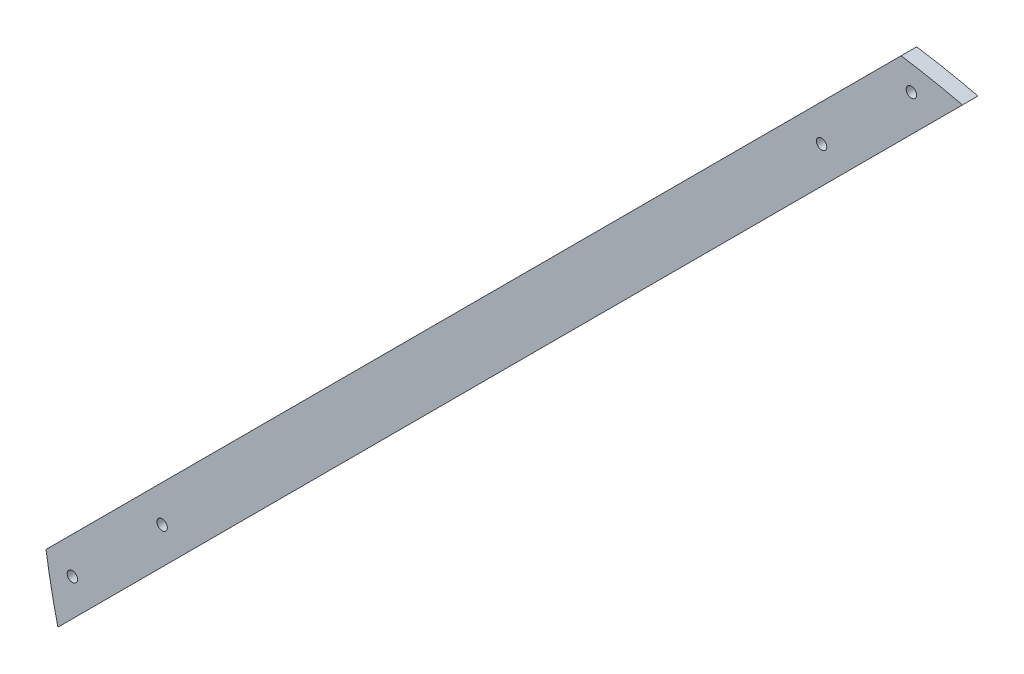
ISO-10303-21;
HEADER;
FILE_DESCRIPTION(('STEP AP214'),'2;1');
FILE_NAME('part.step','',(''),(''),'','','');
FILE_SCHEMA(('AUTOMOTIVE_DESIGN { 1 0 10303 214 1 1 1 1 }'));
ENDSEC;
DATA;
#1=APPLICATION_CONTEXT('core data for automotive mechanical design processes');
#2=APPLICATION_PROTOCOL_DEFINITION('international standard','automotive_design',2000,#1);
#3=PRODUCT_CONTEXT('',#1,'mechanical');
#4=PRODUCT('Part','Part','',(#3));
#5=PRODUCT_RELATED_PRODUCT_CATEGORY('part','',(#4));
#6=PRODUCT_DEFINITION_FORMATION('','',#4);
#7=PRODUCT_DEFINITION_CONTEXT('part definition',#1,'design');
#8=PRODUCT_DEFINITION('design','',#6,#7);
#9=PRODUCT_DEFINITION_SHAPE('','',#8);
#10=(LENGTH_UNIT() NAMED_UNIT(*) SI_UNIT(.MILLI.,.METRE.));
#11=(NAMED_UNIT(*) PLANE_ANGLE_UNIT() SI_UNIT($,.RADIAN.));
#12=(NAMED_UNIT(*) SI_UNIT($,.STERADIAN.) SOLID_ANGLE_UNIT());
#13=UNCERTAINTY_MEASURE_WITH_UNIT(LENGTH_MEASURE(1.E-05),#10,'distance_accuracy_value','');
#14=(GEOMETRIC_REPRESENTATION_CONTEXT(3) GLOBAL_UNCERTAINTY_ASSIGNED_CONTEXT((#13)) GLOBAL_UNIT_ASSIGNED_CONTEXT((#10,
#11,#12)) REPRESENTATION_CONTEXT('',''));
#15=CARTESIAN_POINT('',(0.,0.,0.));
#16=DIRECTION('',(0.,0.,1.));
#17=DIRECTION('',(1.,0.,0.));
#18=AXIS2_PLACEMENT_3D('',#15,#16,#17);
#19=CARTESIAN_POINT('',(0.,0.,3.));
#20=DIRECTION('',(0.,0.,-1.));
#21=DIRECTION('',(-1.,0.,0.));
#22=AXIS2_PLACEMENT_3D('',#19,#20,#21);
#23=CYLINDRICAL_SURFACE('',#22,145.);
#24=CARTESIAN_POINT('',(0.,0.,0.));
#25=DIRECTION('',(0.,0.,1.));
#26=DIRECTION('',(-1.,0.,0.));
#27=AXIS2_PLACEMENT_3D('',#24,#25,#26);
#28=CIRCLE('',#27,145.);
#29=CARTESIAN_POINT('',(33.5028392198031,141.07643234861,0.));
#30=VERTEX_POINT('',#29);
#31=CARTESIAN_POINT('',(21.6577119930423,143.37344074558,0.));
#32=VERTEX_POINT('',#31);
#33=EDGE_CURVE('E101',#30,#32,#28,.T.);
#34=ORIENTED_EDGE('',*,*,#33,.T.);
#35=DIRECTION('',(0.,0.,-1.));
#36=VECTOR('',#35,1.);
#37=CARTESIAN_POINT('',(21.6577119930423,143.37344074558,3.));
#38=LINE('',#37,#36);
#39=CARTESIAN_POINT('',(21.6577119930423,143.37344074558,3.));
#40=VERTEX_POINT('',#39);
#41=EDGE_CURVE('E11',#40,#32,#38,.T.);
#42=ORIENTED_EDGE('',*,*,#41,.F.);
#43=CARTESIAN_POINT('',(0.,0.,3.));
#44=DIRECTION('',(0.,0.,1.));
#45=DIRECTION('',(-1.,0.,0.));
#46=AXIS2_PLACEMENT_3D('',#43,#44,#45);
#47=CIRCLE('',#46,145.);
#48=CARTESIAN_POINT('',(33.5028392198031,141.07643234861,3.));
#49=VERTEX_POINT('',#48);
#50=EDGE_CURVE('E87',#49,#40,#47,.T.);
#51=ORIENTED_EDGE('',*,*,#50,.F.);
#52=DIRECTION('',(0.,0.,-1.));
#53=VECTOR('',#52,1.);
#54=CARTESIAN_POINT('',(33.5028392198031,141.07643234861,3.));
#55=LINE('',#54,#53);
#56=EDGE_CURVE('E97',#49,#30,#55,.T.);
#57=ORIENTED_EDGE('',*,*,#56,.T.);
#58=EDGE_LOOP('',(#34,#42,#51,#57));
#59=FACE_BOUND('',#58,.T.);
#60=ADVANCED_FACE('F37',(#59),#23,.T.);
#61=CARTESIAN_POINT('',(-135.857864376269,-14.1421356237315,3.));
#62=DIRECTION('',(0.707106781186551,-0.707106781186543,0.));
#63=DIRECTION('',(0.707106781186544,0.707106781186552,0.));
#64=AXIS2_PLACEMENT_3D('',#61,#62,#63);
#65=PLANE('',#64);
#66=DIRECTION('',(-0.707106781186543,-0.707106781186551,0.));
#67=VECTOR('',#66,1.);
#68=CARTESIAN_POINT('',(-135.857864376269,-14.1421356237315,0.));
#69=LINE('',#68,#67);
#70=CARTESIAN_POINT('',(-143.37344074558,-21.6577119930428,0.));
#71=VERTEX_POINT('',#70);
#72=EDGE_CURVE('E92',#32,#71,#69,.T.);
#73=ORIENTED_EDGE('',*,*,#72,.T.);
#74=DIRECTION('',(0.,0.,-1.));
#75=VECTOR('',#74,1.);
#76=CARTESIAN_POINT('',(-143.37344074558,-21.6577119930428,3.));
#77=LINE('',#76,#75);
#78=CARTESIAN_POINT('',(-143.37344074558,-21.6577119930428,3.));
#79=VERTEX_POINT('',#78);
#80=EDGE_CURVE('E45',#79,#71,#77,.T.);
#81=ORIENTED_EDGE('',*,*,#80,.F.);
#82=DIRECTION('',(-0.707106781186549,-0.707106781186546,0.));
#83=VECTOR('',#82,1.);
#84=CARTESIAN_POINT('',(14.142135623731,135.857864376269,3.));
#85=LINE('',#84,#83);
#86=EDGE_CURVE('E81',#40,#79,#85,.T.);
#87=ORIENTED_EDGE('',*,*,#86,.F.);
#88=ORIENTED_EDGE('',*,*,#41,.T.);
#89=EDGE_LOOP('',(#73,#81,#87,#88));
#90=FACE_BOUND('',#89,.T.);
#91=ADVANCED_FACE('F91',(#90),#65,.F.);
#92=CARTESIAN_POINT('',(0.,0.,3.));
#93=DIRECTION('',(0.,0.,-1.));
#94=DIRECTION('',(-1.,0.,0.));
#95=AXIS2_PLACEMENT_3D('',#92,#93,#94);
#96=CYLINDRICAL_SURFACE('',#95,145.);
#97=CARTESIAN_POINT('',(0.,0.,0.));
#98=DIRECTION('',(0.,0.,1.));
#99=DIRECTION('',(1.,0.,0.));
#100=AXIS2_PLACEMENT_3D('',#97,#98,#99);
#101=CIRCLE('',#100,145.);
#102=CARTESIAN_POINT('',(-141.07643234861,-33.5028392198037,0.));
#103=VERTEX_POINT('',#102);
#104=EDGE_CURVE('E106',#71,#103,#101,.T.);
#105=ORIENTED_EDGE('',*,*,#104,.T.);
#106=DIRECTION('',(0.,0.,-1.));
#107=VECTOR('',#106,1.);
#108=CARTESIAN_POINT('',(-141.07643234861,-33.5028392198037,3.));
#109=LINE('',#108,#107);
#110=CARTESIAN_POINT('',(-141.07643234861,-33.5028392198037,3.));
#111=VERTEX_POINT('',#110);
#112=EDGE_CURVE('E94',#111,#103,#109,.T.);
#113=ORIENTED_EDGE('',*,*,#112,.F.);
#114=CARTESIAN_POINT('',(0.,0.,3.));
#115=DIRECTION('',(0.,0.,1.));
#116=DIRECTION('',(1.,0.,0.));
#117=AXIS2_PLACEMENT_3D('',#114,#115,#116);
#118=CIRCLE('',#117,145.);
#119=EDGE_CURVE('E84',#79,#111,#118,.T.);
#120=ORIENTED_EDGE('',*,*,#119,.F.);
#121=ORIENTED_EDGE('',*,*,#80,.T.);
#122=EDGE_LOOP('',(#105,#113,#120,#121));
#123=FACE_BOUND('',#122,.T.);
#124=ADVANCED_FACE('F95',(#123),#96,.T.);
#125=CARTESIAN_POINT('',(33.5028392198031,141.07643234861,3.));
#126=DIRECTION('',(-0.707106781186547,0.707106781186548,0.));
#127=DIRECTION('',(-0.707106781186548,-0.707106781186547,0.));
#128=AXIS2_PLACEMENT_3D('',#125,#126,#127);
#129=PLANE('',#128);
#130=DIRECTION('',(0.707106781186548,0.707106781186547,0.));
#131=VECTOR('',#130,1.);
#132=CARTESIAN_POINT('',(33.5028392198031,141.07643234861,0.));
#133=LINE('',#132,#131);
#134=EDGE_CURVE('E70',#103,#30,#133,.T.);
#135=ORIENTED_EDGE('',*,*,#134,.T.);
#136=ORIENTED_EDGE('',*,*,#56,.F.);
#137=DIRECTION('',(0.707106781186542,0.707106781186553,0.));
#138=VECTOR('',#137,1.);
#139=CARTESIAN_POINT('',(-141.07643234861,-33.5028392198037,3.));
#140=LINE('',#139,#138);
#141=EDGE_CURVE('E53',#111,#49,#140,.T.);
#142=ORIENTED_EDGE('',*,*,#141,.F.);
#143=ORIENTED_EDGE('',*,*,#112,.T.);
#144=EDGE_LOOP('',(#135,#136,#142,#143));
#145=FACE_BOUND('',#144,.T.);
#146=ADVANCED_FACE('F110',(#145),#129,.F.);
#147=CARTESIAN_POINT('',(0.,0.,3.));
#148=DIRECTION('',(0.,0.,-1.));
#149=DIRECTION('',(-1.,0.,0.));
#150=AXIS2_PLACEMENT_3D('',#147,#148,#149);
#151=PLANE('',#150);
#152=CARTESIAN_POINT('',(-138.286056916196,-23.6413959755237,3.));
#153=DIRECTION('',(0.,0.,1.));
#154=DIRECTION('',(1.,0.,0.));
#155=AXIS2_PLACEMENT_3D('',#152,#153,#154);
#156=CIRCLE('',#155,0.999999999999998);
#157=CARTESIAN_POINT('',(-137.286056916196,-23.6413959755237,3.));
#158=VERTEX_POINT('',#157);
#159=EDGE_CURVE('E119',#158,#158,#156,.T.);
#160=ORIENTED_EDGE('',*,*,#159,.F.);
#161=EDGE_LOOP('',(#160));
#162=FACE_BOUND('',#161,.T.);
#163=CARTESIAN_POINT('',(23.6413959755237,138.286056916196,3.));
#164=DIRECTION('',(0.,0.,1.));
#165=DIRECTION('',(1.,0.,0.));
#166=AXIS2_PLACEMENT_3D('',#163,#164,#165);
#167=CIRCLE('',#166,1.);
#168=CARTESIAN_POINT('',(24.6413959755237,138.286056916196,3.));
#169=VERTEX_POINT('',#168);
#170=EDGE_CURVE('E125',#169,#169,#167,.T.);
#171=ORIENTED_EDGE('',*,*,#170,.F.);
#172=EDGE_LOOP('',(#171));
#173=FACE_BOUND('',#172,.T.);
#174=CARTESIAN_POINT('',(-120.961940777125,-6.3172798364533,3.));
#175=DIRECTION('',(0.,0.,1.));
#176=DIRECTION('',(1.,0.,0.));
#177=AXIS2_PLACEMENT_3D('',#174,#175,#176);
#178=CIRCLE('',#177,0.999999999999998);
#179=CARTESIAN_POINT('',(-119.961940777125,-6.3172798364533,3.));
#180=VERTEX_POINT('',#179);
#181=EDGE_CURVE('E131',#180,#180,#178,.T.);
#182=ORIENTED_EDGE('',*,*,#181,.F.);
#183=EDGE_LOOP('',(#182));
#184=FACE_BOUND('',#183,.T.);
#185=CARTESIAN_POINT('',(6.3172798364533,120.961940777125,3.));
#186=DIRECTION('',(0.,0.,1.));
#187=DIRECTION('',(1.,0.,0.));
#188=AXIS2_PLACEMENT_3D('',#185,#186,#187);
#189=CIRCLE('',#188,1.);
#190=CARTESIAN_POINT('',(7.3172798364533,120.961940777125,3.));
#191=VERTEX_POINT('',#190);
#192=EDGE_CURVE('E113',#191,#191,#189,.T.);
#193=ORIENTED_EDGE('',*,*,#192,.F.);
#194=EDGE_LOOP('',(#193));
#195=FACE_BOUND('',#194,.T.);
#196=ORIENTED_EDGE('',*,*,#50,.T.);
#197=ORIENTED_EDGE('',*,*,#86,.T.);
#198=ORIENTED_EDGE('',*,*,#119,.T.);
#199=ORIENTED_EDGE('',*,*,#141,.T.);
#200=EDGE_LOOP('',(#196,#197,#198,#199));
#201=FACE_BOUND('',#200,.T.);
#202=ADVANCED_FACE('F82',(#162,#173,#184,#195,#201),#151,.F.);
#203=CARTESIAN_POINT('',(0.,0.,0.));
#204=DIRECTION('',(0.,0.,-1.));
#205=DIRECTION('',(-1.,0.,0.));
#206=AXIS2_PLACEMENT_3D('',#203,#204,#205);
#207=PLANE('',#206);
#208=CARTESIAN_POINT('',(-138.286056916196,-23.6413959755237,0.));
#209=DIRECTION('',(0.,0.,1.));
#210=DIRECTION('',(1.,0.,0.));
#211=AXIS2_PLACEMENT_3D('',#208,#209,#210);
#212=CIRCLE('',#211,0.999999999999998);
#213=CARTESIAN_POINT('',(-137.286056916196,-23.6413959755237,0.));
#214=VERTEX_POINT('',#213);
#215=EDGE_CURVE('E122',#214,#214,#212,.T.);
#216=ORIENTED_EDGE('',*,*,#215,.T.);
#217=EDGE_LOOP('',(#216));
#218=FACE_BOUND('',#217,.T.);
#219=CARTESIAN_POINT('',(23.6413959755237,138.286056916196,0.));
#220=DIRECTION('',(0.,0.,1.));
#221=DIRECTION('',(1.,0.,0.));
#222=AXIS2_PLACEMENT_3D('',#219,#220,#221);
#223=CIRCLE('',#222,1.);
#224=CARTESIAN_POINT('',(24.6413959755237,138.286056916196,0.));
#225=VERTEX_POINT('',#224);
#226=EDGE_CURVE('E128',#225,#225,#223,.T.);
#227=ORIENTED_EDGE('',*,*,#226,.T.);
#228=EDGE_LOOP('',(#227));
#229=FACE_BOUND('',#228,.T.);
#230=CARTESIAN_POINT('',(-120.961940777125,-6.3172798364533,0.));
#231=DIRECTION('',(0.,0.,1.));
#232=DIRECTION('',(1.,0.,0.));
#233=AXIS2_PLACEMENT_3D('',#230,#231,#232);
#234=CIRCLE('',#233,0.999999999999998);
#235=CARTESIAN_POINT('',(-119.961940777125,-6.3172798364533,0.));
#236=VERTEX_POINT('',#235);
#237=EDGE_CURVE('E116',#236,#236,#234,.T.);
#238=ORIENTED_EDGE('',*,*,#237,.T.);
#239=EDGE_LOOP('',(#238));
#240=FACE_BOUND('',#239,.T.);
#241=CARTESIAN_POINT('',(6.3172798364533,120.961940777125,0.));
#242=DIRECTION('',(0.,0.,1.));
#243=DIRECTION('',(1.,0.,0.));
#244=AXIS2_PLACEMENT_3D('',#241,#242,#243);
#245=CIRCLE('',#244,1.);
#246=CARTESIAN_POINT('',(7.3172798364533,120.961940777125,0.));
#247=VERTEX_POINT('',#246);
#248=EDGE_CURVE('E104',#247,#247,#245,.T.);
#249=ORIENTED_EDGE('',*,*,#248,.T.);
#250=EDGE_LOOP('',(#249));
#251=FACE_BOUND('',#250,.T.);
#252=ORIENTED_EDGE('',*,*,#33,.F.);
#253=ORIENTED_EDGE('',*,*,#134,.F.);
#254=ORIENTED_EDGE('',*,*,#104,.F.);
#255=ORIENTED_EDGE('',*,*,#72,.F.);
#256=EDGE_LOOP('',(#252,#253,#254,#255));
#257=FACE_BOUND('',#256,.T.);
#258=ADVANCED_FACE('F137',(#218,#229,#240,#251,#257),#207,.T.);
#259=CARTESIAN_POINT('',(6.3172798364533,120.961940777125,0.));
#260=DIRECTION('',(0.,0.,1.));
#261=DIRECTION('',(1.,0.,0.));
#262=AXIS2_PLACEMENT_3D('',#259,#260,#261);
#263=CYLINDRICAL_SURFACE('',#262,1.);
#264=ORIENTED_EDGE('',*,*,#248,.F.);
#265=EDGE_LOOP('',(#264));
#266=FACE_BOUND('',#265,.T.);
#267=ORIENTED_EDGE('',*,*,#192,.T.);
#268=EDGE_LOOP('',(#267));
#269=FACE_BOUND('',#268,.T.);
#270=ADVANCED_FACE('F144',(#266,#269),#263,.F.);
#271=CARTESIAN_POINT('',(-120.961940777125,-6.3172798364533,0.));
#272=DIRECTION('',(0.,0.,1.));
#273=DIRECTION('',(1.,0.,0.));
#274=AXIS2_PLACEMENT_3D('',#271,#272,#273);
#275=CYLINDRICAL_SURFACE('',#274,0.999999999999998);
#276=ORIENTED_EDGE('',*,*,#237,.F.);
#277=EDGE_LOOP('',(#276));
#278=FACE_BOUND('',#277,.T.);
#279=ORIENTED_EDGE('',*,*,#181,.T.);
#280=EDGE_LOOP('',(#279));
#281=FACE_BOUND('',#280,.T.);
#282=ADVANCED_FACE('F140',(#278,#281),#275,.F.);
#283=CARTESIAN_POINT('',(23.6413959755237,138.286056916196,0.));
#284=DIRECTION('',(0.,0.,1.));
#285=DIRECTION('',(1.,0.,0.));
#286=AXIS2_PLACEMENT_3D('',#283,#284,#285);
#287=CYLINDRICAL_SURFACE('',#286,1.);
#288=ORIENTED_EDGE('',*,*,#226,.F.);
#289=EDGE_LOOP('',(#288));
#290=FACE_BOUND('',#289,.T.);
#291=ORIENTED_EDGE('',*,*,#170,.T.);
#292=EDGE_LOOP('',(#291));
#293=FACE_BOUND('',#292,.T.);
#294=ADVANCED_FACE('F143',(#290,#293),#287,.F.);
#295=CARTESIAN_POINT('',(-138.286056916196,-23.6413959755237,0.));
#296=DIRECTION('',(0.,0.,1.));
#297=DIRECTION('',(1.,0.,0.));
#298=AXIS2_PLACEMENT_3D('',#295,#296,#297);
#299=CYLINDRICAL_SURFACE('',#298,0.999999999999998);
#300=ORIENTED_EDGE('',*,*,#215,.F.);
#301=EDGE_LOOP('',(#300));
#302=FACE_BOUND('',#301,.T.);
#303=ORIENTED_EDGE('',*,*,#159,.T.);
#304=EDGE_LOOP('',(#303));
#305=FACE_BOUND('',#304,.T.);
#306=ADVANCED_FACE('F207',(#302,#305),#299,.F.);
#307=CLOSED_SHELL('',(#60,#91,#124,#146,#202,#258,#270,#282,#294,#306));
#308=MANIFOLD_SOLID_BREP('B2',#307);
#309=ADVANCED_BREP_SHAPE_REPRESENTATION('',(#18,#308),#14);
#310=SHAPE_DEFINITION_REPRESENTATION(#9,#309);
ENDSEC;
END-ISO-10303-21;
